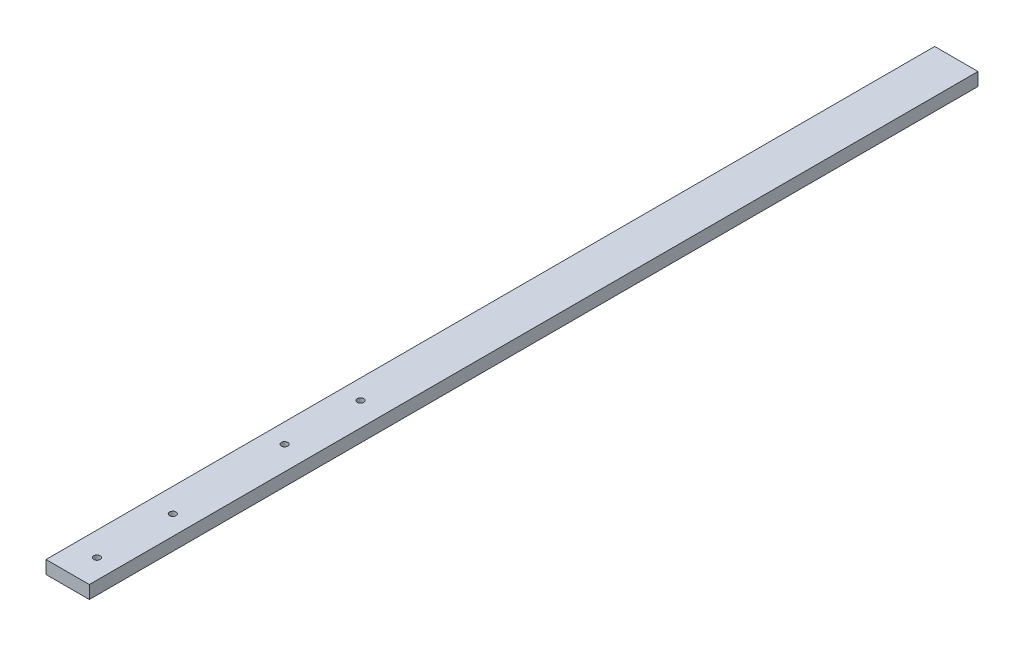
ISO-10303-21;
HEADER;
FILE_DESCRIPTION(('STEP AP214'),'2;1');
FILE_NAME('part.step','',(''),(''),'','','');
FILE_SCHEMA(('AUTOMOTIVE_DESIGN { 1 0 10303 214 1 1 1 1 }'));
ENDSEC;
DATA;
#1=APPLICATION_CONTEXT('core data for automotive mechanical design processes');
#2=APPLICATION_PROTOCOL_DEFINITION('international standard','automotive_design',2000,#1);
#3=PRODUCT_CONTEXT('',#1,'mechanical');
#4=PRODUCT('Part','Part','',(#3));
#5=PRODUCT_RELATED_PRODUCT_CATEGORY('part','',(#4));
#6=PRODUCT_DEFINITION_FORMATION('','',#4);
#7=PRODUCT_DEFINITION_CONTEXT('part definition',#1,'design');
#8=PRODUCT_DEFINITION('design','',#6,#7);
#9=PRODUCT_DEFINITION_SHAPE('','',#8);
#10=(LENGTH_UNIT() NAMED_UNIT(*) SI_UNIT(.MILLI.,.METRE.));
#11=(NAMED_UNIT(*) PLANE_ANGLE_UNIT() SI_UNIT($,.RADIAN.));
#12=(NAMED_UNIT(*) SI_UNIT($,.STERADIAN.) SOLID_ANGLE_UNIT());
#13=UNCERTAINTY_MEASURE_WITH_UNIT(LENGTH_MEASURE(1.E-05),#10,'distance_accuracy_value','');
#14=(GEOMETRIC_REPRESENTATION_CONTEXT(3) GLOBAL_UNCERTAINTY_ASSIGNED_CONTEXT((#13)) GLOBAL_UNIT_ASSIGNED_CONTEXT((#10,
#11,#12)) REPRESENTATION_CONTEXT('',''));
#15=CARTESIAN_POINT('',(0.,0.,0.));
#16=DIRECTION('',(0.,0.,1.));
#17=DIRECTION('',(1.,0.,0.));
#18=AXIS2_PLACEMENT_3D('',#15,#16,#17);
#19=CARTESIAN_POINT('',(-10.,6.,205.));
#20=DIRECTION('',(1.,0.,0.));
#21=DIRECTION('',(0.,0.,-1.));
#22=AXIS2_PLACEMENT_3D('',#19,#20,#21);
#23=PLANE('',#22);
#24=DIRECTION('',(0.,0.,1.));
#25=VECTOR('',#24,1.);
#26=CARTESIAN_POINT('',(-10.,0.,205.));
#27=LINE('',#26,#25);
#28=CARTESIAN_POINT('',(-10.,0.,-204.999999999999));
#29=VERTEX_POINT('',#28);
#30=CARTESIAN_POINT('',(-10.,0.,205.));
#31=VERTEX_POINT('',#30);
#32=EDGE_CURVE('E96',#29,#31,#27,.T.);
#33=ORIENTED_EDGE('',*,*,#32,.T.);
#34=DIRECTION('',(0.,-1.,0.));
#35=VECTOR('',#34,1.);
#36=CARTESIAN_POINT('',(-10.,6.,205.));
#37=LINE('',#36,#35);
#38=CARTESIAN_POINT('',(-10.,6.,205.));
#39=VERTEX_POINT('',#38);
#40=EDGE_CURVE('E11',#39,#31,#37,.T.);
#41=ORIENTED_EDGE('',*,*,#40,.F.);
#42=DIRECTION('',(0.,0.,1.));
#43=VECTOR('',#42,1.);
#44=CARTESIAN_POINT('',(-10.,6.,205.));
#45=LINE('',#44,#43);
#46=CARTESIAN_POINT('',(-10.,6.,-204.999999999999));
#47=VERTEX_POINT('',#46);
#48=EDGE_CURVE('E84',#47,#39,#45,.T.);
#49=ORIENTED_EDGE('',*,*,#48,.F.);
#50=DIRECTION('',(0.,-1.,0.));
#51=VECTOR('',#50,1.);
#52=CARTESIAN_POINT('',(-10.,6.,-204.999999999999));
#53=LINE('',#52,#51);
#54=EDGE_CURVE('E92',#47,#29,#53,.T.);
#55=ORIENTED_EDGE('',*,*,#54,.T.);
#56=EDGE_LOOP('',(#33,#41,#49,#55));
#57=FACE_BOUND('',#56,.T.);
#58=ADVANCED_FACE('F33',(#57),#23,.F.);
#59=CARTESIAN_POINT('',(9.99999999999999,6.,205.));
#60=DIRECTION('',(0.,0.,-1.));
#61=DIRECTION('',(-1.,0.,0.));
#62=AXIS2_PLACEMENT_3D('',#59,#60,#61);
#63=PLANE('',#62);
#64=DIRECTION('',(1.,0.,0.));
#65=VECTOR('',#64,1.);
#66=CARTESIAN_POINT('',(9.99999999999999,0.,205.));
#67=LINE('',#66,#65);
#68=CARTESIAN_POINT('',(9.99999999999999,0.,205.));
#69=VERTEX_POINT('',#68);
#70=EDGE_CURVE('E88',#31,#69,#67,.T.);
#71=ORIENTED_EDGE('',*,*,#70,.T.);
#72=DIRECTION('',(0.,-1.,0.));
#73=VECTOR('',#72,1.);
#74=CARTESIAN_POINT('',(9.99999999999999,6.,205.));
#75=LINE('',#74,#73);
#76=CARTESIAN_POINT('',(9.99999999999999,6.,205.));
#77=VERTEX_POINT('',#76);
#78=EDGE_CURVE('E41',#77,#69,#75,.T.);
#79=ORIENTED_EDGE('',*,*,#78,.F.);
#80=DIRECTION('',(1.,0.,0.));
#81=VECTOR('',#80,1.);
#82=CARTESIAN_POINT('',(9.99999999999999,6.,205.));
#83=LINE('',#82,#81);
#84=EDGE_CURVE('E79',#39,#77,#83,.T.);
#85=ORIENTED_EDGE('',*,*,#84,.F.);
#86=ORIENTED_EDGE('',*,*,#40,.T.);
#87=EDGE_LOOP('',(#71,#79,#85,#86));
#88=FACE_BOUND('',#87,.T.);
#89=ADVANCED_FACE('F87',(#88),#63,.F.);
#90=CARTESIAN_POINT('',(9.99999999999999,6.,205.));
#91=DIRECTION('',(-1.,0.,0.));
#92=DIRECTION('',(0.,0.,1.));
#93=AXIS2_PLACEMENT_3D('',#90,#91,#92);
#94=PLANE('',#93);
#95=DIRECTION('',(0.,0.,-1.));
#96=VECTOR('',#95,1.);
#97=CARTESIAN_POINT('',(9.99999999999999,0.,205.));
#98=LINE('',#97,#96);
#99=CARTESIAN_POINT('',(9.99999999999999,0.,-204.999999999999));
#100=VERTEX_POINT('',#99);
#101=EDGE_CURVE('E66',#69,#100,#98,.T.);
#102=ORIENTED_EDGE('',*,*,#101,.T.);
#103=DIRECTION('',(0.,-1.,0.));
#104=VECTOR('',#103,1.);
#105=CARTESIAN_POINT('',(9.99999999999999,6.,-204.999999999999));
#106=LINE('',#105,#104);
#107=CARTESIAN_POINT('',(9.99999999999999,6.,-204.999999999999));
#108=VERTEX_POINT('',#107);
#109=EDGE_CURVE('E89',#108,#100,#106,.T.);
#110=ORIENTED_EDGE('',*,*,#109,.F.);
#111=DIRECTION('',(0.,0.,-1.));
#112=VECTOR('',#111,1.);
#113=CARTESIAN_POINT('',(9.99999999999999,6.,205.));
#114=LINE('',#113,#112);
#115=EDGE_CURVE('E82',#77,#108,#114,.T.);
#116=ORIENTED_EDGE('',*,*,#115,.F.);
#117=ORIENTED_EDGE('',*,*,#78,.T.);
#118=EDGE_LOOP('',(#102,#110,#116,#117));
#119=FACE_BOUND('',#118,.T.);
#120=ADVANCED_FACE('F90',(#119),#94,.F.);
#121=CARTESIAN_POINT('',(9.99999999999999,6.,-204.999999999999));
#122=DIRECTION('',(0.,0.,1.));
#123=DIRECTION('',(1.,0.,0.));
#124=AXIS2_PLACEMENT_3D('',#121,#122,#123);
#125=PLANE('',#124);
#126=DIRECTION('',(-1.,0.,0.));
#127=VECTOR('',#126,1.);
#128=CARTESIAN_POINT('',(9.99999999999999,0.,-204.999999999999));
#129=LINE('',#128,#127);
#130=EDGE_CURVE('E72',#100,#29,#129,.T.);
#131=ORIENTED_EDGE('',*,*,#130,.T.);
#132=ORIENTED_EDGE('',*,*,#54,.F.);
#133=DIRECTION('',(-1.,0.,0.));
#134=VECTOR('',#133,1.);
#135=CARTESIAN_POINT('',(9.99999999999999,6.,-204.999999999999));
#136=LINE('',#135,#134);
#137=EDGE_CURVE('E49',#108,#47,#136,.T.);
#138=ORIENTED_EDGE('',*,*,#137,.F.);
#139=ORIENTED_EDGE('',*,*,#109,.T.);
#140=EDGE_LOOP('',(#131,#132,#138,#139));
#141=FACE_BOUND('',#140,.T.);
#142=ADVANCED_FACE('F104',(#141),#125,.F.);
#143=CARTESIAN_POINT('',(0.,6.,0.));
#144=DIRECTION('',(0.,1.,0.));
#145=DIRECTION('',(0.,0.,1.));
#146=AXIS2_PLACEMENT_3D('',#143,#144,#145);
#147=PLANE('',#146);
#148=CARTESIAN_POINT('',(1.00000000000002,6.,192.5));
#149=DIRECTION('',(0.,1.,0.));
#150=DIRECTION('',(0.,0.,1.));
#151=AXIS2_PLACEMENT_3D('',#148,#149,#150);
#152=CIRCLE('',#151,1.5);
#153=CARTESIAN_POINT('',(1.00000000000002,6.,194.));
#154=VERTEX_POINT('',#153);
#155=EDGE_CURVE('E128',#154,#154,#152,.T.);
#156=ORIENTED_EDGE('',*,*,#155,.F.);
#157=EDGE_LOOP('',(#156));
#158=FACE_BOUND('',#157,.T.);
#159=CARTESIAN_POINT('',(1.00000000000001,6.,157.5));
#160=DIRECTION('',(0.,1.,0.));
#161=DIRECTION('',(0.,0.,1.));
#162=AXIS2_PLACEMENT_3D('',#159,#160,#161);
#163=CIRCLE('',#162,1.5);
#164=CARTESIAN_POINT('',(1.00000000000001,6.,159.));
#165=VERTEX_POINT('',#164);
#166=EDGE_CURVE('E122',#165,#165,#163,.T.);
#167=ORIENTED_EDGE('',*,*,#166,.F.);
#168=EDGE_LOOP('',(#167));
#169=FACE_BOUND('',#168,.T.);
#170=CARTESIAN_POINT('',(-0.999999999999995,6.,103.9));
#171=DIRECTION('',(0.,1.,0.));
#172=DIRECTION('',(0.,0.,1.));
#173=AXIS2_PLACEMENT_3D('',#170,#171,#172);
#174=CIRCLE('',#173,1.5);
#175=CARTESIAN_POINT('',(-0.999999999999995,6.,105.4));
#176=VERTEX_POINT('',#175);
#177=EDGE_CURVE('E116',#176,#176,#174,.T.);
#178=ORIENTED_EDGE('',*,*,#177,.F.);
#179=EDGE_LOOP('',(#178));
#180=FACE_BOUND('',#179,.T.);
#181=CARTESIAN_POINT('',(-1.,6.,68.9000000000004));
#182=DIRECTION('',(0.,1.,0.));
#183=DIRECTION('',(0.,0.,1.));
#184=AXIS2_PLACEMENT_3D('',#181,#182,#183);
#185=CIRCLE('',#184,1.5);
#186=CARTESIAN_POINT('',(-1.,6.,70.4000000000004));
#187=VERTEX_POINT('',#186);
#188=EDGE_CURVE('E110',#187,#187,#185,.T.);
#189=ORIENTED_EDGE('',*,*,#188,.F.);
#190=EDGE_LOOP('',(#189));
#191=FACE_BOUND('',#190,.T.);
#192=ORIENTED_EDGE('',*,*,#48,.T.);
#193=ORIENTED_EDGE('',*,*,#84,.T.);
#194=ORIENTED_EDGE('',*,*,#115,.T.);
#195=ORIENTED_EDGE('',*,*,#137,.T.);
#196=EDGE_LOOP('',(#192,#193,#194,#195));
#197=FACE_BOUND('',#196,.T.);
#198=ADVANCED_FACE('F80',(#158,#169,#180,#191,#197),#147,.T.);
#199=CARTESIAN_POINT('',(0.,0.,0.));
#200=DIRECTION('',(0.,1.,0.));
#201=DIRECTION('',(0.,0.,1.));
#202=AXIS2_PLACEMENT_3D('',#199,#200,#201);
#203=PLANE('',#202);
#204=CARTESIAN_POINT('',(1.00000000000002,0.,192.5));
#205=DIRECTION('',(0.,1.,0.));
#206=DIRECTION('',(0.,0.,1.));
#207=AXIS2_PLACEMENT_3D('',#204,#205,#206);
#208=CIRCLE('',#207,1.5);
#209=CARTESIAN_POINT('',(1.00000000000002,0.,194.));
#210=VERTEX_POINT('',#209);
#211=EDGE_CURVE('E99',#210,#210,#208,.T.);
#212=ORIENTED_EDGE('',*,*,#211,.T.);
#213=EDGE_LOOP('',(#212));
#214=FACE_BOUND('',#213,.T.);
#215=CARTESIAN_POINT('',(1.00000000000001,0.,157.5));
#216=DIRECTION('',(0.,1.,0.));
#217=DIRECTION('',(0.,0.,1.));
#218=AXIS2_PLACEMENT_3D('',#215,#216,#217);
#219=CIRCLE('',#218,1.5);
#220=CARTESIAN_POINT('',(1.00000000000001,0.,159.));
#221=VERTEX_POINT('',#220);
#222=EDGE_CURVE('E125',#221,#221,#219,.T.);
#223=ORIENTED_EDGE('',*,*,#222,.T.);
#224=EDGE_LOOP('',(#223));
#225=FACE_BOUND('',#224,.T.);
#226=CARTESIAN_POINT('',(-0.999999999999995,0.,103.9));
#227=DIRECTION('',(0.,1.,0.));
#228=DIRECTION('',(0.,0.,1.));
#229=AXIS2_PLACEMENT_3D('',#226,#227,#228);
#230=CIRCLE('',#229,1.5);
#231=CARTESIAN_POINT('',(-0.999999999999995,0.,105.4));
#232=VERTEX_POINT('',#231);
#233=EDGE_CURVE('E119',#232,#232,#230,.T.);
#234=ORIENTED_EDGE('',*,*,#233,.T.);
#235=EDGE_LOOP('',(#234));
#236=FACE_BOUND('',#235,.T.);
#237=CARTESIAN_POINT('',(-1.,0.,68.9000000000004));
#238=DIRECTION('',(0.,1.,0.));
#239=DIRECTION('',(0.,0.,1.));
#240=AXIS2_PLACEMENT_3D('',#237,#238,#239);
#241=CIRCLE('',#240,1.5);
#242=CARTESIAN_POINT('',(-1.,0.,70.4000000000004));
#243=VERTEX_POINT('',#242);
#244=EDGE_CURVE('E113',#243,#243,#241,.T.);
#245=ORIENTED_EDGE('',*,*,#244,.T.);
#246=EDGE_LOOP('',(#245));
#247=FACE_BOUND('',#246,.T.);
#248=ORIENTED_EDGE('',*,*,#32,.F.);
#249=ORIENTED_EDGE('',*,*,#130,.F.);
#250=ORIENTED_EDGE('',*,*,#101,.F.);
#251=ORIENTED_EDGE('',*,*,#70,.F.);
#252=EDGE_LOOP('',(#248,#249,#250,#251));
#253=FACE_BOUND('',#252,.T.);
#254=ADVANCED_FACE('F107',(#214,#225,#236,#247,#253),#203,.F.);
#255=CARTESIAN_POINT('',(-1.,0.,68.9000000000004));
#256=DIRECTION('',(0.,1.,0.));
#257=DIRECTION('',(0.,0.,1.));
#258=AXIS2_PLACEMENT_3D('',#255,#256,#257);
#259=CYLINDRICAL_SURFACE('',#258,1.5);
#260=ORIENTED_EDGE('',*,*,#244,.F.);
#261=EDGE_LOOP('',(#260));
#262=FACE_BOUND('',#261,.T.);
#263=ORIENTED_EDGE('',*,*,#188,.T.);
#264=EDGE_LOOP('',(#263));
#265=FACE_BOUND('',#264,.T.);
#266=ADVANCED_FACE('F152',(#262,#265),#259,.F.);
#267=CARTESIAN_POINT('',(-0.999999999999995,0.,103.9));
#268=DIRECTION('',(0.,1.,0.));
#269=DIRECTION('',(0.,0.,1.));
#270=AXIS2_PLACEMENT_3D('',#267,#268,#269);
#271=CYLINDRICAL_SURFACE('',#270,1.5);
#272=ORIENTED_EDGE('',*,*,#233,.F.);
#273=EDGE_LOOP('',(#272));
#274=FACE_BOUND('',#273,.T.);
#275=ORIENTED_EDGE('',*,*,#177,.T.);
#276=EDGE_LOOP('',(#275));
#277=FACE_BOUND('',#276,.T.);
#278=ADVANCED_FACE('F154',(#274,#277),#271,.F.);
#279=CARTESIAN_POINT('',(1.00000000000001,0.,157.5));
#280=DIRECTION('',(0.,1.,0.));
#281=DIRECTION('',(0.,0.,1.));
#282=AXIS2_PLACEMENT_3D('',#279,#280,#281);
#283=CYLINDRICAL_SURFACE('',#282,1.5);
#284=ORIENTED_EDGE('',*,*,#222,.F.);
#285=EDGE_LOOP('',(#284));
#286=FACE_BOUND('',#285,.T.);
#287=ORIENTED_EDGE('',*,*,#166,.T.);
#288=EDGE_LOOP('',(#287));
#289=FACE_BOUND('',#288,.T.);
#290=ADVANCED_FACE('F139',(#286,#289),#283,.F.);
#291=CARTESIAN_POINT('',(1.00000000000002,0.,192.5));
#292=DIRECTION('',(0.,1.,0.));
#293=DIRECTION('',(0.,0.,1.));
#294=AXIS2_PLACEMENT_3D('',#291,#292,#293);
#295=CYLINDRICAL_SURFACE('',#294,1.5);
#296=ORIENTED_EDGE('',*,*,#211,.F.);
#297=EDGE_LOOP('',(#296));
#298=FACE_BOUND('',#297,.T.);
#299=ORIENTED_EDGE('',*,*,#155,.T.);
#300=EDGE_LOOP('',(#299));
#301=FACE_BOUND('',#300,.T.);
#302=ADVANCED_FACE('F136',(#298,#301),#295,.F.);
#303=CLOSED_SHELL('',(#58,#89,#120,#142,#198,#254,#266,#278,#290,#302));
#304=MANIFOLD_SOLID_BREP('B2',#303);
#305=ADVANCED_BREP_SHAPE_REPRESENTATION('',(#18,#304),#14);
#306=SHAPE_DEFINITION_REPRESENTATION(#9,#305);
ENDSEC;
END-ISO-10303-21;
